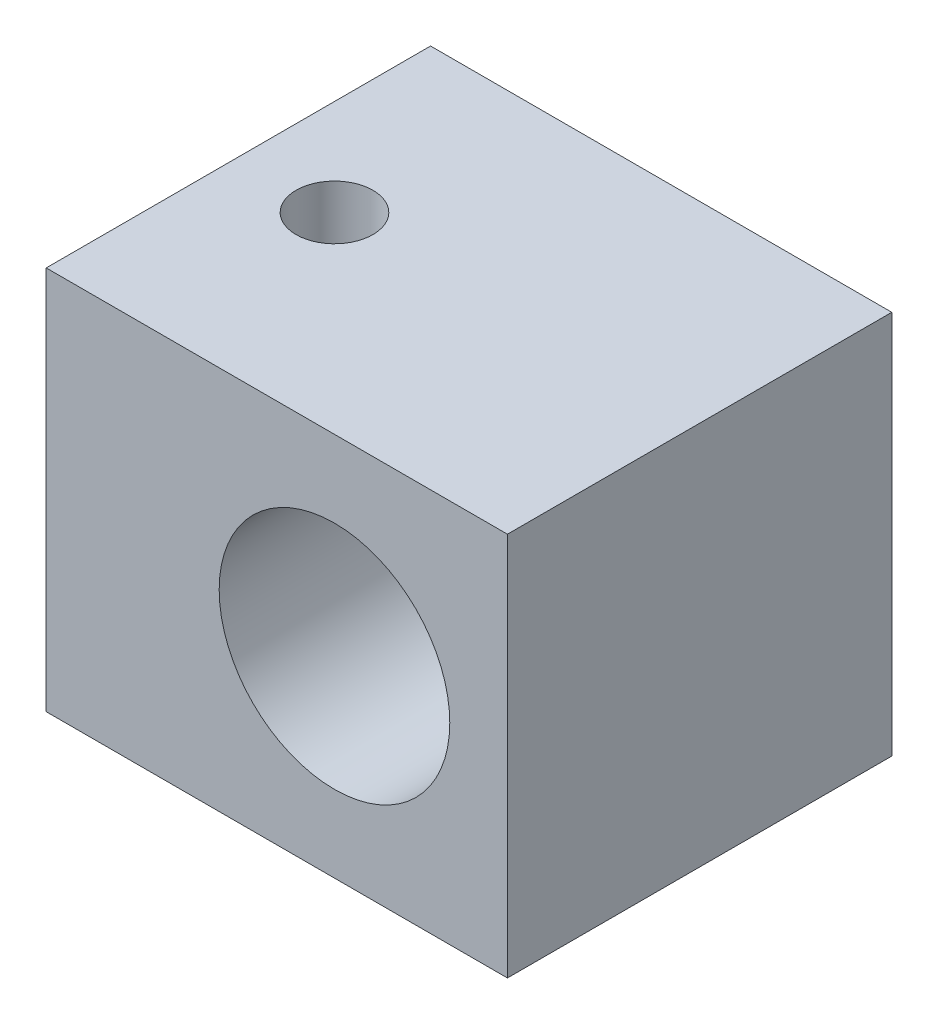
ISO-10303-21;
HEADER;
FILE_DESCRIPTION(('STEP AP214'),'2;1');
FILE_NAME('part.step','',(''),(''),'','','');
FILE_SCHEMA(('AUTOMOTIVE_DESIGN { 1 0 10303 214 1 1 1 1 }'));
ENDSEC;
DATA;
#1=APPLICATION_CONTEXT('core data for automotive mechanical design processes');
#2=APPLICATION_PROTOCOL_DEFINITION('international standard','automotive_design',2000,#1);
#3=PRODUCT_CONTEXT('',#1,'mechanical');
#4=PRODUCT('Part','Part','',(#3));
#5=PRODUCT_RELATED_PRODUCT_CATEGORY('part','',(#4));
#6=PRODUCT_DEFINITION_FORMATION('','',#4);
#7=PRODUCT_DEFINITION_CONTEXT('part definition',#1,'design');
#8=PRODUCT_DEFINITION('design','',#6,#7);
#9=PRODUCT_DEFINITION_SHAPE('','',#8);
#10=(LENGTH_UNIT() NAMED_UNIT(*) SI_UNIT(.MILLI.,.METRE.));
#11=(NAMED_UNIT(*) PLANE_ANGLE_UNIT() SI_UNIT($,.RADIAN.));
#12=(NAMED_UNIT(*) SI_UNIT($,.STERADIAN.) SOLID_ANGLE_UNIT());
#13=UNCERTAINTY_MEASURE_WITH_UNIT(LENGTH_MEASURE(1.E-05),#10,'distance_accuracy_value','');
#14=(GEOMETRIC_REPRESENTATION_CONTEXT(3) GLOBAL_UNCERTAINTY_ASSIGNED_CONTEXT((#13)) GLOBAL_UNIT_ASSIGNED_CONTEXT((#10,
#11,#12)) REPRESENTATION_CONTEXT('',''));
#15=CARTESIAN_POINT('',(0.,0.,0.));
#16=DIRECTION('',(0.,0.,1.));
#17=DIRECTION('',(1.,0.,0.));
#18=AXIS2_PLACEMENT_3D('',#15,#16,#17);
#19=CARTESIAN_POINT('',(0.,0.,10.));
#20=DIRECTION('',(1.,0.,0.));
#21=DIRECTION('',(0.,0.,-1.));
#22=AXIS2_PLACEMENT_3D('',#19,#20,#21);
#23=PLANE('',#22);
#24=DIRECTION('',(0.,-1.,0.));
#25=VECTOR('',#24,1.);
#26=CARTESIAN_POINT('',(0.,0.,0.));
#27=LINE('',#26,#25);
#28=CARTESIAN_POINT('',(0.,0.,0.));
#29=VERTEX_POINT('',#28);
#30=CARTESIAN_POINT('',(0.,-10.,0.));
#31=VERTEX_POINT('',#30);
#32=EDGE_CURVE('E100',#29,#31,#27,.T.);
#33=ORIENTED_EDGE('',*,*,#32,.T.);
#34=DIRECTION('',(0.,0.,-1.));
#35=VECTOR('',#34,1.);
#36=CARTESIAN_POINT('',(0.,-10.,10.));
#37=LINE('',#36,#35);
#38=CARTESIAN_POINT('',(0.,-10.,10.));
#39=VERTEX_POINT('',#38);
#40=EDGE_CURVE('E11',#39,#31,#37,.T.);
#41=ORIENTED_EDGE('',*,*,#40,.F.);
#42=DIRECTION('',(0.,-1.,0.));
#43=VECTOR('',#42,1.);
#44=CARTESIAN_POINT('',(0.,0.,10.));
#45=LINE('',#44,#43);
#46=CARTESIAN_POINT('',(0.,0.,10.));
#47=VERTEX_POINT('',#46);
#48=EDGE_CURVE('E88',#47,#39,#45,.T.);
#49=ORIENTED_EDGE('',*,*,#48,.F.);
#50=DIRECTION('',(0.,0.,-1.));
#51=VECTOR('',#50,1.);
#52=CARTESIAN_POINT('',(0.,0.,10.));
#53=LINE('',#52,#51);
#54=EDGE_CURVE('E96',#47,#29,#53,.T.);
#55=ORIENTED_EDGE('',*,*,#54,.T.);
#56=EDGE_LOOP('',(#33,#41,#49,#55));
#57=FACE_BOUND('',#56,.T.);
#58=ADVANCED_FACE('F37',(#57),#23,.F.);
#59=CARTESIAN_POINT('',(0.,-10.,10.));
#60=DIRECTION('',(0.,1.,0.));
#61=DIRECTION('',(0.,0.,1.));
#62=AXIS2_PLACEMENT_3D('',#59,#60,#61);
#63=PLANE('',#62);
#64=CARTESIAN_POINT('',(2.5,-10.,5.));
#65=DIRECTION('',(0.,1.,0.));
#66=DIRECTION('',(0.,0.,1.));
#67=AXIS2_PLACEMENT_3D('',#64,#65,#66);
#68=CIRCLE('',#67,1.);
#69=CARTESIAN_POINT('',(2.5,-10.,6.));
#70=VERTEX_POINT('',#69);
#71=EDGE_CURVE('E117',#70,#70,#68,.T.);
#72=ORIENTED_EDGE('',*,*,#71,.T.);
#73=EDGE_LOOP('',(#72));
#74=FACE_BOUND('',#73,.T.);
#75=DIRECTION('',(1.,0.,0.));
#76=VECTOR('',#75,1.);
#77=CARTESIAN_POINT('',(0.,-10.,0.));
#78=LINE('',#77,#76);
#79=CARTESIAN_POINT('',(12.,-10.,0.));
#80=VERTEX_POINT('',#79);
#81=EDGE_CURVE('E92',#31,#80,#78,.T.);
#82=ORIENTED_EDGE('',*,*,#81,.T.);
#83=DIRECTION('',(0.,0.,-1.));
#84=VECTOR('',#83,1.);
#85=CARTESIAN_POINT('',(12.,-10.,10.));
#86=LINE('',#85,#84);
#87=CARTESIAN_POINT('',(12.,-10.,10.));
#88=VERTEX_POINT('',#87);
#89=EDGE_CURVE('E45',#88,#80,#86,.T.);
#90=ORIENTED_EDGE('',*,*,#89,.F.);
#91=DIRECTION('',(1.,0.,0.));
#92=VECTOR('',#91,1.);
#93=CARTESIAN_POINT('',(0.,-10.,10.));
#94=LINE('',#93,#92);
#95=EDGE_CURVE('E83',#39,#88,#94,.T.);
#96=ORIENTED_EDGE('',*,*,#95,.F.);
#97=ORIENTED_EDGE('',*,*,#40,.T.);
#98=EDGE_LOOP('',(#82,#90,#96,#97));
#99=FACE_BOUND('',#98,.T.);
#100=ADVANCED_FACE('F91',(#74,#99),#63,.F.);
#101=CARTESIAN_POINT('',(12.,0.,10.));
#102=DIRECTION('',(-1.,0.,0.));
#103=DIRECTION('',(0.,-1.,0.));
#104=AXIS2_PLACEMENT_3D('',#101,#102,#103);
#105=PLANE('',#104);
#106=DIRECTION('',(0.,1.,0.));
#107=VECTOR('',#106,1.);
#108=CARTESIAN_POINT('',(12.,0.,0.));
#109=LINE('',#108,#107);
#110=CARTESIAN_POINT('',(12.,0.,0.));
#111=VERTEX_POINT('',#110);
#112=EDGE_CURVE('E70',#80,#111,#109,.T.);
#113=ORIENTED_EDGE('',*,*,#112,.T.);
#114=DIRECTION('',(0.,0.,-1.));
#115=VECTOR('',#114,1.);
#116=CARTESIAN_POINT('',(12.,0.,10.));
#117=LINE('',#116,#115);
#118=CARTESIAN_POINT('',(12.,0.,10.));
#119=VERTEX_POINT('',#118);
#120=EDGE_CURVE('E93',#119,#111,#117,.T.);
#121=ORIENTED_EDGE('',*,*,#120,.F.);
#122=DIRECTION('',(0.,1.,0.));
#123=VECTOR('',#122,1.);
#124=CARTESIAN_POINT('',(12.,0.,10.));
#125=LINE('',#124,#123);
#126=EDGE_CURVE('E86',#88,#119,#125,.T.);
#127=ORIENTED_EDGE('',*,*,#126,.F.);
#128=ORIENTED_EDGE('',*,*,#89,.T.);
#129=EDGE_LOOP('',(#113,#121,#127,#128));
#130=FACE_BOUND('',#129,.T.);
#131=ADVANCED_FACE('F94',(#130),#105,.F.);
#132=CARTESIAN_POINT('',(0.,0.,10.));
#133=DIRECTION('',(0.,-1.,0.));
#134=DIRECTION('',(0.,0.,-1.));
#135=AXIS2_PLACEMENT_3D('',#132,#133,#134);
#136=PLANE('',#135);
#137=CARTESIAN_POINT('',(2.5,0.,5.));
#138=DIRECTION('',(0.,1.,0.));
#139=DIRECTION('',(0.,0.,1.));
#140=AXIS2_PLACEMENT_3D('',#137,#138,#139);
#141=CIRCLE('',#140,1.);
#142=CARTESIAN_POINT('',(2.5,0.,6.));
#143=VERTEX_POINT('',#142);
#144=EDGE_CURVE('E120',#143,#143,#141,.T.);
#145=ORIENTED_EDGE('',*,*,#144,.F.);
#146=EDGE_LOOP('',(#145));
#147=FACE_BOUND('',#146,.T.);
#148=DIRECTION('',(-1.,0.,0.));
#149=VECTOR('',#148,1.);
#150=CARTESIAN_POINT('',(0.,0.,0.));
#151=LINE('',#150,#149);
#152=EDGE_CURVE('E76',#111,#29,#151,.T.);
#153=ORIENTED_EDGE('',*,*,#152,.T.);
#154=ORIENTED_EDGE('',*,*,#54,.F.);
#155=DIRECTION('',(-1.,0.,0.));
#156=VECTOR('',#155,1.);
#157=CARTESIAN_POINT('',(0.,0.,10.));
#158=LINE('',#157,#156);
#159=EDGE_CURVE('E53',#119,#47,#158,.T.);
#160=ORIENTED_EDGE('',*,*,#159,.F.);
#161=ORIENTED_EDGE('',*,*,#120,.T.);
#162=EDGE_LOOP('',(#153,#154,#160,#161));
#163=FACE_BOUND('',#162,.T.);
#164=ADVANCED_FACE('F108',(#147,#163),#136,.F.);
#165=CARTESIAN_POINT('',(0.,0.,10.));
#166=DIRECTION('',(0.,0.,1.));
#167=DIRECTION('',(1.,0.,0.));
#168=AXIS2_PLACEMENT_3D('',#165,#166,#167);
#169=PLANE('',#168);
#170=CARTESIAN_POINT('',(7.5,-5.,10.));
#171=DIRECTION('',(0.,0.,1.));
#172=DIRECTION('',(1.,0.,0.));
#173=AXIS2_PLACEMENT_3D('',#170,#171,#172);
#174=CIRCLE('',#173,3.);
#175=CARTESIAN_POINT('',(10.5,-5.,10.));
#176=VERTEX_POINT('',#175);
#177=EDGE_CURVE('E103',#176,#176,#174,.T.);
#178=ORIENTED_EDGE('',*,*,#177,.F.);
#179=EDGE_LOOP('',(#178));
#180=FACE_BOUND('',#179,.T.);
#181=ORIENTED_EDGE('',*,*,#48,.T.);
#182=ORIENTED_EDGE('',*,*,#95,.T.);
#183=ORIENTED_EDGE('',*,*,#126,.T.);
#184=ORIENTED_EDGE('',*,*,#159,.T.);
#185=EDGE_LOOP('',(#181,#182,#183,#184));
#186=FACE_BOUND('',#185,.T.);
#187=ADVANCED_FACE('F84',(#180,#186),#169,.T.);
#188=CARTESIAN_POINT('',(0.,0.,0.));
#189=DIRECTION('',(0.,0.,1.));
#190=DIRECTION('',(1.,0.,0.));
#191=AXIS2_PLACEMENT_3D('',#188,#189,#190);
#192=PLANE('',#191);
#193=CARTESIAN_POINT('',(7.5,-5.,0.));
#194=DIRECTION('',(0.,0.,1.));
#195=DIRECTION('',(1.,0.,0.));
#196=AXIS2_PLACEMENT_3D('',#193,#194,#195);
#197=CIRCLE('',#196,3.);
#198=CARTESIAN_POINT('',(10.5,-5.,0.));
#199=VERTEX_POINT('',#198);
#200=EDGE_CURVE('E114',#199,#199,#197,.T.);
#201=ORIENTED_EDGE('',*,*,#200,.T.);
#202=EDGE_LOOP('',(#201));
#203=FACE_BOUND('',#202,.T.);
#204=ORIENTED_EDGE('',*,*,#32,.F.);
#205=ORIENTED_EDGE('',*,*,#152,.F.);
#206=ORIENTED_EDGE('',*,*,#112,.F.);
#207=ORIENTED_EDGE('',*,*,#81,.F.);
#208=EDGE_LOOP('',(#204,#205,#206,#207));
#209=FACE_BOUND('',#208,.T.);
#210=ADVANCED_FACE('F111',(#203,#209),#192,.F.);
#211=CARTESIAN_POINT('',(7.5,-5.,10.));
#212=DIRECTION('',(0.,0.,-1.));
#213=DIRECTION('',(-1.,0.,0.));
#214=AXIS2_PLACEMENT_3D('',#211,#212,#213);
#215=CYLINDRICAL_SURFACE('',#214,3.);
#216=ORIENTED_EDGE('',*,*,#177,.T.);
#217=EDGE_LOOP('',(#216));
#218=FACE_BOUND('',#217,.T.);
#219=ORIENTED_EDGE('',*,*,#200,.F.);
#220=EDGE_LOOP('',(#219));
#221=FACE_BOUND('',#220,.T.);
#222=ADVANCED_FACE('F130',(#218,#221),#215,.F.);
#223=CARTESIAN_POINT('',(2.5,-10.,5.));
#224=DIRECTION('',(0.,1.,0.));
#225=DIRECTION('',(0.,0.,1.));
#226=AXIS2_PLACEMENT_3D('',#223,#224,#225);
#227=CYLINDRICAL_SURFACE('',#226,1.);
#228=ORIENTED_EDGE('',*,*,#71,.F.);
#229=EDGE_LOOP('',(#228));
#230=FACE_BOUND('',#229,.T.);
#231=ORIENTED_EDGE('',*,*,#144,.T.);
#232=EDGE_LOOP('',(#231));
#233=FACE_BOUND('',#232,.T.);
#234=ADVANCED_FACE('F127',(#230,#233),#227,.F.);
#235=CLOSED_SHELL('',(#58,#100,#131,#164,#187,#210,#222,#234));
#236=MANIFOLD_SOLID_BREP('B2',#235);
#237=ADVANCED_BREP_SHAPE_REPRESENTATION('',(#18,#236),#14);
#238=SHAPE_DEFINITION_REPRESENTATION(#9,#237);
ENDSEC;
END-ISO-10303-21;
